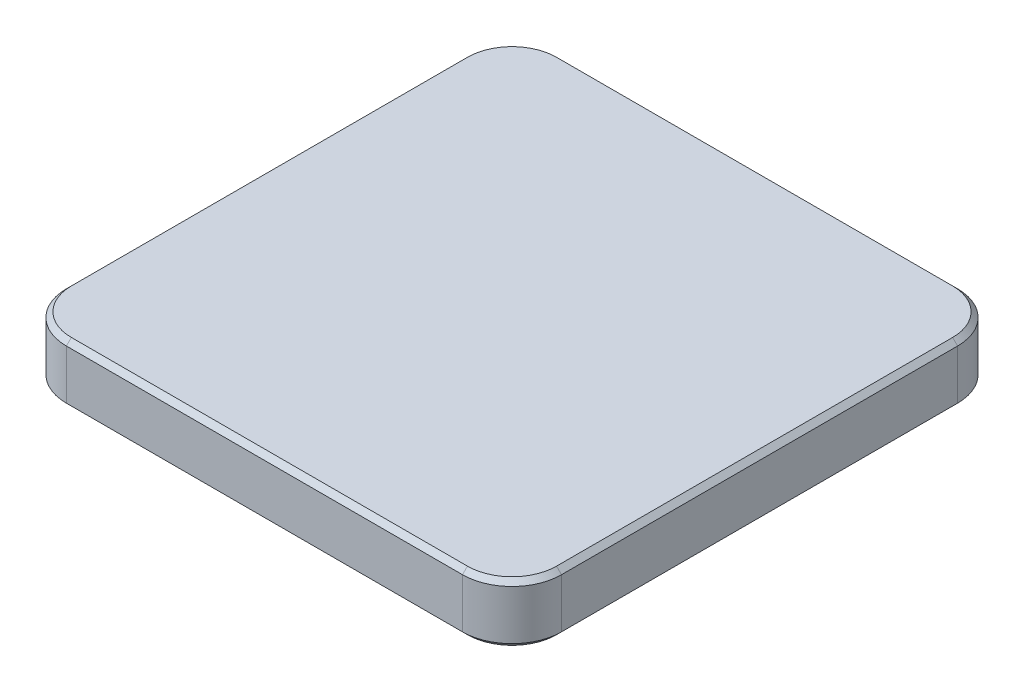
ISO-10303-21;
HEADER;
FILE_DESCRIPTION(('STEP AP214'),'2;1');
FILE_NAME('part.step','',(''),(''),'','','');
FILE_SCHEMA(('AUTOMOTIVE_DESIGN { 1 0 10303 214 1 1 1 1 }'));
ENDSEC;
DATA;
#1=APPLICATION_CONTEXT('core data for automotive mechanical design processes');
#2=APPLICATION_PROTOCOL_DEFINITION('international standard','automotive_design',2000,#1);
#3=PRODUCT_CONTEXT('',#1,'mechanical');
#4=PRODUCT('Part','Part','',(#3));
#5=PRODUCT_RELATED_PRODUCT_CATEGORY('part','',(#4));
#6=PRODUCT_DEFINITION_FORMATION('','',#4);
#7=PRODUCT_DEFINITION_CONTEXT('part definition',#1,'design');
#8=PRODUCT_DEFINITION('design','',#6,#7);
#9=PRODUCT_DEFINITION_SHAPE('','',#8);
#10=(LENGTH_UNIT() NAMED_UNIT(*) SI_UNIT(.MILLI.,.METRE.));
#11=(NAMED_UNIT(*) PLANE_ANGLE_UNIT() SI_UNIT($,.RADIAN.));
#12=(NAMED_UNIT(*) SI_UNIT($,.STERADIAN.) SOLID_ANGLE_UNIT());
#13=UNCERTAINTY_MEASURE_WITH_UNIT(LENGTH_MEASURE(1.E-05),#10,'distance_accuracy_value','');
#14=(GEOMETRIC_REPRESENTATION_CONTEXT(3) GLOBAL_UNCERTAINTY_ASSIGNED_CONTEXT((#13)) GLOBAL_UNIT_ASSIGNED_CONTEXT((#10,
#11,#12)) REPRESENTATION_CONTEXT('',''));
#15=CARTESIAN_POINT('',(0.,0.,0.));
#16=DIRECTION('',(0.,0.,1.));
#17=DIRECTION('',(1.,0.,0.));
#18=AXIS2_PLACEMENT_3D('',#15,#16,#17);
#19=CARTESIAN_POINT('',(-40.,12.,40.));
#20=DIRECTION('',(0.,-1.,0.));
#21=DIRECTION('',(0.,0.,-1.));
#22=AXIS2_PLACEMENT_3D('',#19,#20,#21);
#23=CYLINDRICAL_SURFACE('',#22,10.);
#24=DIRECTION('',(0.,-1.,0.));
#25=VECTOR('',#24,1.);
#26=CARTESIAN_POINT('',(-50.,12.,39.9999999999999));
#27=LINE('',#26,#25);
#28=CARTESIAN_POINT('',(-50.,11.,39.9999999999999));
#29=VERTEX_POINT('',#28);
#30=CARTESIAN_POINT('',(-50.,0.999999999999997,39.9999999999999));
#31=VERTEX_POINT('',#30);
#32=EDGE_CURVE('E268',#29,#31,#27,.T.);
#33=ORIENTED_EDGE('',*,*,#32,.T.);
#34=CARTESIAN_POINT('',(-40.,0.999999999999997,40.));
#35=DIRECTION('',(0.,-1.,0.));
#36=DIRECTION('',(0.,0.,-1.));
#37=AXIS2_PLACEMENT_3D('',#34,#35,#36);
#38=CIRCLE('',#37,10.);
#39=CARTESIAN_POINT('',(-39.9999999999999,0.999999999999997,50.));
#40=VERTEX_POINT('',#39);
#41=EDGE_CURVE('E233',#31,#40,#38,.F.);
#42=ORIENTED_EDGE('',*,*,#41,.T.);
#43=DIRECTION('',(0.,-1.,0.));
#44=VECTOR('',#43,1.);
#45=CARTESIAN_POINT('',(-39.9999999999999,12.,50.));
#46=LINE('',#45,#44);
#47=CARTESIAN_POINT('',(-39.9999999999999,11.,50.));
#48=VERTEX_POINT('',#47);
#49=EDGE_CURVE('E172',#48,#40,#46,.T.);
#50=ORIENTED_EDGE('',*,*,#49,.F.);
#51=CARTESIAN_POINT('',(-40.,11.,40.));
#52=DIRECTION('',(0.,-1.,0.));
#53=DIRECTION('',(0.,0.,-1.));
#54=AXIS2_PLACEMENT_3D('',#51,#52,#53);
#55=CIRCLE('',#54,10.);
#56=EDGE_CURVE('E231',#48,#29,#55,.T.);
#57=ORIENTED_EDGE('',*,*,#56,.T.);
#58=EDGE_LOOP('',(#33,#42,#50,#57));
#59=FACE_BOUND('',#58,.T.);
#60=ADVANCED_FACE('F35',(#59),#23,.T.);
#61=CARTESIAN_POINT('',(-39.9999999999999,12.,50.));
#62=DIRECTION('',(0.,0.,-1.));
#63=DIRECTION('',(-1.,0.,0.));
#64=AXIS2_PLACEMENT_3D('',#61,#62,#63);
#65=PLANE('',#64);
#66=ORIENTED_EDGE('',*,*,#49,.T.);
#67=DIRECTION('',(1.,0.,0.));
#68=VECTOR('',#67,1.);
#69=CARTESIAN_POINT('',(39.9999999999999,0.999999999999997,50.));
#70=LINE('',#69,#68);
#71=CARTESIAN_POINT('',(39.9999999999999,0.999999999999997,50.));
#72=VERTEX_POINT('',#71);
#73=EDGE_CURVE('E171',#40,#72,#70,.T.);
#74=ORIENTED_EDGE('',*,*,#73,.T.);
#75=DIRECTION('',(0.,-1.,0.));
#76=VECTOR('',#75,1.);
#77=CARTESIAN_POINT('',(39.9999999999999,12.,50.));
#78=LINE('',#77,#76);
#79=CARTESIAN_POINT('',(39.9999999999999,11.,50.));
#80=VERTEX_POINT('',#79);
#81=EDGE_CURVE('E153',#80,#72,#78,.T.);
#82=ORIENTED_EDGE('',*,*,#81,.F.);
#83=DIRECTION('',(-1.,0.,0.));
#84=VECTOR('',#83,1.);
#85=CARTESIAN_POINT('',(-39.9999999999999,11.,50.));
#86=LINE('',#85,#84);
#87=EDGE_CURVE('E168',#80,#48,#86,.T.);
#88=ORIENTED_EDGE('',*,*,#87,.T.);
#89=EDGE_LOOP('',(#66,#74,#82,#88));
#90=FACE_BOUND('',#89,.T.);
#91=ADVANCED_FACE('F166',(#90),#65,.F.);
#92=CARTESIAN_POINT('',(40.,12.,40.));
#93=DIRECTION('',(0.,-1.,0.));
#94=DIRECTION('',(0.,0.,-1.));
#95=AXIS2_PLACEMENT_3D('',#92,#93,#94);
#96=CYLINDRICAL_SURFACE('',#95,10.);
#97=ORIENTED_EDGE('',*,*,#81,.T.);
#98=CARTESIAN_POINT('',(40.,0.999999999999997,40.));
#99=DIRECTION('',(0.,-1.,0.));
#100=DIRECTION('',(0.,0.,-1.));
#101=AXIS2_PLACEMENT_3D('',#98,#99,#100);
#102=CIRCLE('',#101,10.);
#103=CARTESIAN_POINT('',(50.,0.999999999999997,39.9999999999999));
#104=VERTEX_POINT('',#103);
#105=EDGE_CURVE('E160',#72,#104,#102,.F.);
#106=ORIENTED_EDGE('',*,*,#105,.T.);
#107=DIRECTION('',(0.,-1.,0.));
#108=VECTOR('',#107,1.);
#109=CARTESIAN_POINT('',(50.,12.,39.9999999999999));
#110=LINE('',#109,#108);
#111=CARTESIAN_POINT('',(50.,11.,39.9999999999999));
#112=VERTEX_POINT('',#111);
#113=EDGE_CURVE('E155',#112,#104,#110,.T.);
#114=ORIENTED_EDGE('',*,*,#113,.F.);
#115=CARTESIAN_POINT('',(40.,11.,40.));
#116=DIRECTION('',(0.,-1.,0.));
#117=DIRECTION('',(0.,0.,-1.));
#118=AXIS2_PLACEMENT_3D('',#115,#116,#117);
#119=CIRCLE('',#118,10.);
#120=EDGE_CURVE('E150',#112,#80,#119,.T.);
#121=ORIENTED_EDGE('',*,*,#120,.T.);
#122=EDGE_LOOP('',(#97,#106,#114,#121));
#123=FACE_BOUND('',#122,.T.);
#124=ADVANCED_FACE('F152',(#123),#96,.T.);
#125=CARTESIAN_POINT('',(50.,12.,39.9999999999999));
#126=DIRECTION('',(-1.,0.,0.));
#127=DIRECTION('',(0.,0.,1.));
#128=AXIS2_PLACEMENT_3D('',#125,#126,#127);
#129=PLANE('',#128);
#130=ORIENTED_EDGE('',*,*,#113,.T.);
#131=DIRECTION('',(0.,0.,-1.));
#132=VECTOR('',#131,1.);
#133=CARTESIAN_POINT('',(50.,0.999999999999997,-39.9999999999999));
#134=LINE('',#133,#132);
#135=CARTESIAN_POINT('',(50.,0.999999999999997,-39.9999999999999));
#136=VERTEX_POINT('',#135);
#137=EDGE_CURVE('E212',#104,#136,#134,.T.);
#138=ORIENTED_EDGE('',*,*,#137,.T.);
#139=DIRECTION('',(0.,-1.,0.));
#140=VECTOR('',#139,1.);
#141=CARTESIAN_POINT('',(50.,12.,-39.9999999999999));
#142=LINE('',#141,#140);
#143=CARTESIAN_POINT('',(50.,11.,-39.9999999999999));
#144=VERTEX_POINT('',#143);
#145=EDGE_CURVE('E293',#144,#136,#142,.T.);
#146=ORIENTED_EDGE('',*,*,#145,.F.);
#147=DIRECTION('',(0.,0.,1.));
#148=VECTOR('',#147,1.);
#149=CARTESIAN_POINT('',(50.,11.,39.9999999999999));
#150=LINE('',#149,#148);
#151=EDGE_CURVE('E210',#144,#112,#150,.T.);
#152=ORIENTED_EDGE('',*,*,#151,.T.);
#153=EDGE_LOOP('',(#130,#138,#146,#152));
#154=FACE_BOUND('',#153,.T.);
#155=ADVANCED_FACE('F290',(#154),#129,.F.);
#156=CARTESIAN_POINT('',(40.,12.,-40.));
#157=DIRECTION('',(0.,-1.,0.));
#158=DIRECTION('',(0.,0.,-1.));
#159=AXIS2_PLACEMENT_3D('',#156,#157,#158);
#160=CYLINDRICAL_SURFACE('',#159,10.);
#161=ORIENTED_EDGE('',*,*,#145,.T.);
#162=CARTESIAN_POINT('',(40.,0.999999999999997,-40.));
#163=DIRECTION('',(0.,-1.,0.));
#164=DIRECTION('',(0.,0.,-1.));
#165=AXIS2_PLACEMENT_3D('',#162,#163,#164);
#166=CIRCLE('',#165,10.);
#167=CARTESIAN_POINT('',(39.9999999999999,0.999999999999997,-50.));
#168=VERTEX_POINT('',#167);
#169=EDGE_CURVE('E216',#136,#168,#166,.F.);
#170=ORIENTED_EDGE('',*,*,#169,.T.);
#171=DIRECTION('',(0.,-1.,0.));
#172=VECTOR('',#171,1.);
#173=CARTESIAN_POINT('',(39.9999999999999,12.,-50.));
#174=LINE('',#173,#172);
#175=CARTESIAN_POINT('',(39.9999999999999,11.,-50.));
#176=VERTEX_POINT('',#175);
#177=EDGE_CURVE('E296',#176,#168,#174,.T.);
#178=ORIENTED_EDGE('',*,*,#177,.F.);
#179=CARTESIAN_POINT('',(40.,11.,-40.));
#180=DIRECTION('',(0.,-1.,0.));
#181=DIRECTION('',(0.,0.,-1.));
#182=AXIS2_PLACEMENT_3D('',#179,#180,#181);
#183=CIRCLE('',#182,10.);
#184=EDGE_CURVE('E214',#176,#144,#183,.T.);
#185=ORIENTED_EDGE('',*,*,#184,.T.);
#186=EDGE_LOOP('',(#161,#170,#178,#185));
#187=FACE_BOUND('',#186,.T.);
#188=ADVANCED_FACE('F341',(#187),#160,.T.);
#189=CARTESIAN_POINT('',(-39.9999999999999,12.,-50.));
#190=DIRECTION('',(0.,0.,1.));
#191=DIRECTION('',(1.,0.,0.));
#192=AXIS2_PLACEMENT_3D('',#189,#190,#191);
#193=PLANE('',#192);
#194=ORIENTED_EDGE('',*,*,#177,.T.);
#195=DIRECTION('',(-1.,0.,0.));
#196=VECTOR('',#195,1.);
#197=CARTESIAN_POINT('',(-39.9999999999999,0.999999999999997,-50.));
#198=LINE('',#197,#196);
#199=CARTESIAN_POINT('',(-39.9999999999999,0.999999999999997,-50.));
#200=VERTEX_POINT('',#199);
#201=EDGE_CURVE('E220',#168,#200,#198,.T.);
#202=ORIENTED_EDGE('',*,*,#201,.T.);
#203=DIRECTION('',(0.,-1.,0.));
#204=VECTOR('',#203,1.);
#205=CARTESIAN_POINT('',(-39.9999999999999,12.,-50.));
#206=LINE('',#205,#204);
#207=CARTESIAN_POINT('',(-39.9999999999999,11.,-50.));
#208=VERTEX_POINT('',#207);
#209=EDGE_CURVE('E300',#208,#200,#206,.T.);
#210=ORIENTED_EDGE('',*,*,#209,.F.);
#211=DIRECTION('',(1.,0.,0.));
#212=VECTOR('',#211,1.);
#213=CARTESIAN_POINT('',(-39.9999999999999,11.,-50.));
#214=LINE('',#213,#212);
#215=EDGE_CURVE('E218',#208,#176,#214,.T.);
#216=ORIENTED_EDGE('',*,*,#215,.T.);
#217=EDGE_LOOP('',(#194,#202,#210,#216));
#218=FACE_BOUND('',#217,.T.);
#219=ADVANCED_FACE('F344',(#218),#193,.F.);
#220=CARTESIAN_POINT('',(-40.,12.,-40.));
#221=DIRECTION('',(0.,-1.,0.));
#222=DIRECTION('',(0.,0.,-1.));
#223=AXIS2_PLACEMENT_3D('',#220,#221,#222);
#224=CYLINDRICAL_SURFACE('',#223,10.);
#225=ORIENTED_EDGE('',*,*,#209,.T.);
#226=CARTESIAN_POINT('',(-40.,0.999999999999997,-40.));
#227=DIRECTION('',(0.,-1.,0.));
#228=DIRECTION('',(0.,0.,-1.));
#229=AXIS2_PLACEMENT_3D('',#226,#227,#228);
#230=CIRCLE('',#229,10.);
#231=CARTESIAN_POINT('',(-50.,0.999999999999997,-39.9999999999999));
#232=VERTEX_POINT('',#231);
#233=EDGE_CURVE('E224',#200,#232,#230,.F.);
#234=ORIENTED_EDGE('',*,*,#233,.T.);
#235=DIRECTION('',(0.,-1.,0.));
#236=VECTOR('',#235,1.);
#237=CARTESIAN_POINT('',(-50.,12.,-39.9999999999999));
#238=LINE('',#237,#236);
#239=CARTESIAN_POINT('',(-50.,11.,-39.9999999999999));
#240=VERTEX_POINT('',#239);
#241=EDGE_CURVE('E305',#240,#232,#238,.T.);
#242=ORIENTED_EDGE('',*,*,#241,.F.);
#243=CARTESIAN_POINT('',(-40.,11.,-40.));
#244=DIRECTION('',(0.,-1.,0.));
#245=DIRECTION('',(0.,0.,-1.));
#246=AXIS2_PLACEMENT_3D('',#243,#244,#245);
#247=CIRCLE('',#246,10.);
#248=EDGE_CURVE('E222',#240,#208,#247,.T.);
#249=ORIENTED_EDGE('',*,*,#248,.T.);
#250=EDGE_LOOP('',(#225,#234,#242,#249));
#251=FACE_BOUND('',#250,.T.);
#252=ADVANCED_FACE('F358',(#251),#224,.T.);
#253=CARTESIAN_POINT('',(-50.,12.,39.9999999999999));
#254=DIRECTION('',(1.,0.,0.));
#255=DIRECTION('',(0.,0.,-1.));
#256=AXIS2_PLACEMENT_3D('',#253,#254,#255);
#257=PLANE('',#256);
#258=ORIENTED_EDGE('',*,*,#241,.T.);
#259=DIRECTION('',(0.,0.,1.));
#260=VECTOR('',#259,1.);
#261=CARTESIAN_POINT('',(-50.,0.999999999999997,39.9999999999999));
#262=LINE('',#261,#260);
#263=EDGE_CURVE('E229',#232,#31,#262,.T.);
#264=ORIENTED_EDGE('',*,*,#263,.T.);
#265=ORIENTED_EDGE('',*,*,#32,.F.);
#266=DIRECTION('',(0.,0.,-1.));
#267=VECTOR('',#266,1.);
#268=CARTESIAN_POINT('',(-50.,11.,39.9999999999999));
#269=LINE('',#268,#267);
#270=EDGE_CURVE('E226',#29,#240,#269,.T.);
#271=ORIENTED_EDGE('',*,*,#270,.T.);
#272=EDGE_LOOP('',(#258,#264,#265,#271));
#273=FACE_BOUND('',#272,.T.);
#274=ADVANCED_FACE('F359',(#273),#257,.F.);
#275=CARTESIAN_POINT('',(-40.,12.,40.));
#276=DIRECTION('',(0.,-1.,0.));
#277=DIRECTION('',(0.,0.,-1.));
#278=AXIS2_PLACEMENT_3D('',#275,#276,#277);
#279=PLANE('',#278);
#280=CARTESIAN_POINT('',(-40.,12.,-40.));
#281=DIRECTION('',(0.,-1.,0.));
#282=DIRECTION('',(0.,0.,-1.));
#283=AXIS2_PLACEMENT_3D('',#280,#281,#282);
#284=CIRCLE('',#283,9.00000000000001);
#285=CARTESIAN_POINT('',(-39.9999999999999,12.,-49.));
#286=VERTEX_POINT('',#285);
#287=CARTESIAN_POINT('',(-49.,12.,-39.9999999999999));
#288=VERTEX_POINT('',#287);
#289=EDGE_CURVE('E45',#286,#288,#284,.F.);
#290=ORIENTED_EDGE('',*,*,#289,.T.);
#291=DIRECTION('',(0.,0.,1.));
#292=VECTOR('',#291,1.);
#293=CARTESIAN_POINT('',(-49.,12.,40.));
#294=LINE('',#293,#292);
#295=CARTESIAN_POINT('',(-49.,12.,39.9999999999999));
#296=VERTEX_POINT('',#295);
#297=EDGE_CURVE('E11',#288,#296,#294,.T.);
#298=ORIENTED_EDGE('',*,*,#297,.T.);
#299=CARTESIAN_POINT('',(-40.,12.,40.));
#300=DIRECTION('',(0.,-1.,0.));
#301=DIRECTION('',(0.,0.,-1.));
#302=AXIS2_PLACEMENT_3D('',#299,#300,#301);
#303=CIRCLE('',#302,9.00000000000001);
#304=CARTESIAN_POINT('',(-39.9999999999999,12.,49.));
#305=VERTEX_POINT('',#304);
#306=EDGE_CURVE('E235',#296,#305,#303,.F.);
#307=ORIENTED_EDGE('',*,*,#306,.T.);
#308=DIRECTION('',(1.,0.,0.));
#309=VECTOR('',#308,1.);
#310=CARTESIAN_POINT('',(-40.,12.,49.));
#311=LINE('',#310,#309);
#312=CARTESIAN_POINT('',(39.9999999999999,12.,49.));
#313=VERTEX_POINT('',#312);
#314=EDGE_CURVE('E237',#305,#313,#311,.T.);
#315=ORIENTED_EDGE('',*,*,#314,.T.);
#316=CARTESIAN_POINT('',(40.,12.,40.));
#317=DIRECTION('',(0.,-1.,0.));
#318=DIRECTION('',(0.,0.,-1.));
#319=AXIS2_PLACEMENT_3D('',#316,#317,#318);
#320=CIRCLE('',#319,9.00000000000001);
#321=CARTESIAN_POINT('',(49.,12.,39.9999999999999));
#322=VERTEX_POINT('',#321);
#323=EDGE_CURVE('E178',#313,#322,#320,.F.);
#324=ORIENTED_EDGE('',*,*,#323,.T.);
#325=DIRECTION('',(0.,0.,-1.));
#326=VECTOR('',#325,1.);
#327=CARTESIAN_POINT('',(49.,12.,40.));
#328=LINE('',#327,#326);
#329=CARTESIAN_POINT('',(49.,12.,-39.9999999999999));
#330=VERTEX_POINT('',#329);
#331=EDGE_CURVE('E240',#322,#330,#328,.T.);
#332=ORIENTED_EDGE('',*,*,#331,.T.);
#333=CARTESIAN_POINT('',(40.,12.,-40.));
#334=DIRECTION('',(0.,-1.,0.));
#335=DIRECTION('',(0.,0.,-1.));
#336=AXIS2_PLACEMENT_3D('',#333,#334,#335);
#337=CIRCLE('',#336,9.00000000000001);
#338=CARTESIAN_POINT('',(39.9999999999999,12.,-49.));
#339=VERTEX_POINT('',#338);
#340=EDGE_CURVE('E242',#330,#339,#337,.F.);
#341=ORIENTED_EDGE('',*,*,#340,.T.);
#342=DIRECTION('',(-1.,0.,0.));
#343=VECTOR('',#342,1.);
#344=CARTESIAN_POINT('',(-40.,12.,-49.));
#345=LINE('',#344,#343);
#346=EDGE_CURVE('E56',#339,#286,#345,.T.);
#347=ORIENTED_EDGE('',*,*,#346,.T.);
#348=EDGE_LOOP('',(#290,#298,#307,#315,#324,#332,#341,#347));
#349=FACE_BOUND('',#348,.T.);
#350=ADVANCED_FACE('F368',(#349),#279,.F.);
#351=CARTESIAN_POINT('',(-40.,0.,40.));
#352=DIRECTION('',(0.,-1.,0.));
#353=DIRECTION('',(0.,0.,-1.));
#354=AXIS2_PLACEMENT_3D('',#351,#352,#353);
#355=PLANE('',#354);
#356=CARTESIAN_POINT('',(40.,0.,40.));
#357=DIRECTION('',(0.,-1.,0.));
#358=DIRECTION('',(0.,0.,-1.));
#359=AXIS2_PLACEMENT_3D('',#356,#357,#358);
#360=CIRCLE('',#359,9.00000000000001);
#361=CARTESIAN_POINT('',(49.,0.,39.9999999999999));
#362=VERTEX_POINT('',#361);
#363=CARTESIAN_POINT('',(39.9999999999999,0.,49.));
#364=VERTEX_POINT('',#363);
#365=EDGE_CURVE('E205',#362,#364,#360,.T.);
#366=ORIENTED_EDGE('',*,*,#365,.T.);
#367=DIRECTION('',(-1.,0.,0.));
#368=VECTOR('',#367,1.);
#369=CARTESIAN_POINT('',(-39.9999999999999,0.,49.));
#370=LINE('',#369,#368);
#371=CARTESIAN_POINT('',(-39.9999999999999,0.,49.));
#372=VERTEX_POINT('',#371);
#373=EDGE_CURVE('E161',#364,#372,#370,.T.);
#374=ORIENTED_EDGE('',*,*,#373,.T.);
#375=CARTESIAN_POINT('',(-40.,0.,40.));
#376=DIRECTION('',(0.,-1.,0.));
#377=DIRECTION('',(0.,0.,-1.));
#378=AXIS2_PLACEMENT_3D('',#375,#376,#377);
#379=CIRCLE('',#378,9.00000000000001);
#380=CARTESIAN_POINT('',(-49.,0.,39.9999999999999));
#381=VERTEX_POINT('',#380);
#382=EDGE_CURVE('E190',#372,#381,#379,.T.);
#383=ORIENTED_EDGE('',*,*,#382,.T.);
#384=DIRECTION('',(0.,0.,-1.));
#385=VECTOR('',#384,1.);
#386=CARTESIAN_POINT('',(-49.,0.,-39.9999999999999));
#387=LINE('',#386,#385);
#388=CARTESIAN_POINT('',(-49.,0.,-39.9999999999999));
#389=VERTEX_POINT('',#388);
#390=EDGE_CURVE('E195',#381,#389,#387,.T.);
#391=ORIENTED_EDGE('',*,*,#390,.T.);
#392=CARTESIAN_POINT('',(-40.,0.,-40.));
#393=DIRECTION('',(0.,-1.,0.));
#394=DIRECTION('',(0.,0.,-1.));
#395=AXIS2_PLACEMENT_3D('',#392,#393,#394);
#396=CIRCLE('',#395,9.00000000000001);
#397=CARTESIAN_POINT('',(-39.9999999999999,0.,-49.));
#398=VERTEX_POINT('',#397);
#399=EDGE_CURVE('E197',#389,#398,#396,.T.);
#400=ORIENTED_EDGE('',*,*,#399,.T.);
#401=DIRECTION('',(1.,0.,0.));
#402=VECTOR('',#401,1.);
#403=CARTESIAN_POINT('',(39.9999999999999,0.,-49.));
#404=LINE('',#403,#402);
#405=CARTESIAN_POINT('',(39.9999999999999,0.,-49.));
#406=VERTEX_POINT('',#405);
#407=EDGE_CURVE('E199',#398,#406,#404,.T.);
#408=ORIENTED_EDGE('',*,*,#407,.T.);
#409=CARTESIAN_POINT('',(40.,0.,-40.));
#410=DIRECTION('',(0.,-1.,0.));
#411=DIRECTION('',(0.,0.,-1.));
#412=AXIS2_PLACEMENT_3D('',#409,#410,#411);
#413=CIRCLE('',#412,9.00000000000001);
#414=CARTESIAN_POINT('',(49.,0.,-39.9999999999999));
#415=VERTEX_POINT('',#414);
#416=EDGE_CURVE('E201',#406,#415,#413,.T.);
#417=ORIENTED_EDGE('',*,*,#416,.T.);
#418=DIRECTION('',(0.,0.,1.));
#419=VECTOR('',#418,1.);
#420=CARTESIAN_POINT('',(49.,0.,39.9999999999999));
#421=LINE('',#420,#419);
#422=EDGE_CURVE('E203',#415,#362,#421,.T.);
#423=ORIENTED_EDGE('',*,*,#422,.T.);
#424=EDGE_LOOP('',(#366,#374,#383,#391,#400,#408,#417,#423));
#425=FACE_BOUND('',#424,.T.);
#426=ADVANCED_FACE('F370',(#425),#355,.T.);
#427=CARTESIAN_POINT('',(-39.9999999999999,0.999999999999997,-50.));
#428=DIRECTION('',(0.,-0.707106781186544,-0.707106781186551));
#429=DIRECTION('',(1.,0.,0.));
#430=AXIS2_PLACEMENT_3D('',#427,#428,#429);
#431=PLANE('',#430);
#432=DIRECTION('',(0.,0.707106781186551,-0.707106781186544));
#433=VECTOR('',#432,1.);
#434=CARTESIAN_POINT('',(39.9999999999999,0.,-49.));
#435=LINE('',#434,#433);
#436=EDGE_CURVE('E262',#406,#168,#435,.T.);
#437=ORIENTED_EDGE('',*,*,#436,.F.);
#438=ORIENTED_EDGE('',*,*,#407,.F.);
#439=DIRECTION('',(0.,-0.707106781186551,0.707106781186544));
#440=VECTOR('',#439,1.);
#441=CARTESIAN_POINT('',(-39.9999999999999,0.999999999999997,-50.));
#442=LINE('',#441,#440);
#443=EDGE_CURVE('E265',#200,#398,#442,.T.);
#444=ORIENTED_EDGE('',*,*,#443,.F.);
#445=ORIENTED_EDGE('',*,*,#201,.F.);
#446=EDGE_LOOP('',(#437,#438,#444,#445));
#447=FACE_BOUND('',#446,.T.);
#448=ADVANCED_FACE('F349',(#447),#431,.T.);
#449=CARTESIAN_POINT('',(-40.,0.999999999999997,-40.));
#450=DIRECTION('',(0.,1.,0.));
#451=DIRECTION('',(0.,0.,1.));
#452=AXIS2_PLACEMENT_3D('',#449,#450,#451);
#453=CONICAL_SURFACE('',#452,10.,0.785398163397445);
#454=ORIENTED_EDGE('',*,*,#443,.T.);
#455=ORIENTED_EDGE('',*,*,#399,.F.);
#456=DIRECTION('',(0.707106781186544,-0.707106781186551,0.));
#457=VECTOR('',#456,1.);
#458=CARTESIAN_POINT('',(-50.,0.999999999999997,-39.9999999999999));
#459=LINE('',#458,#457);
#460=EDGE_CURVE('E259',#232,#389,#459,.T.);
#461=ORIENTED_EDGE('',*,*,#460,.F.);
#462=ORIENTED_EDGE('',*,*,#233,.F.);
#463=EDGE_LOOP('',(#454,#455,#461,#462));
#464=FACE_BOUND('',#463,.T.);
#465=ADVANCED_FACE('F355',(#464),#453,.T.);
#466=CARTESIAN_POINT('',(40.,0.999999999999997,-40.));
#467=DIRECTION('',(0.,1.,0.));
#468=DIRECTION('',(0.,0.,1.));
#469=AXIS2_PLACEMENT_3D('',#466,#467,#468);
#470=CONICAL_SURFACE('',#469,10.,0.785398163397445);
#471=ORIENTED_EDGE('',*,*,#436,.T.);
#472=ORIENTED_EDGE('',*,*,#169,.F.);
#473=DIRECTION('',(0.707106781186546,0.707106781186549,0.));
#474=VECTOR('',#473,1.);
#475=CARTESIAN_POINT('',(49.,0.,-39.9999999999999));
#476=LINE('',#475,#474);
#477=EDGE_CURVE('E256',#415,#136,#476,.T.);
#478=ORIENTED_EDGE('',*,*,#477,.F.);
#479=ORIENTED_EDGE('',*,*,#416,.F.);
#480=EDGE_LOOP('',(#471,#472,#478,#479));
#481=FACE_BOUND('',#480,.T.);
#482=ADVANCED_FACE('F338',(#481),#470,.T.);
#483=CARTESIAN_POINT('',(-50.,0.999999999999997,39.9999999999999));
#484=DIRECTION('',(-0.707106781186549,-0.707106781186546,0.));
#485=DIRECTION('',(0.,0.,-1.));
#486=AXIS2_PLACEMENT_3D('',#483,#484,#485);
#487=PLANE('',#486);
#488=ORIENTED_EDGE('',*,*,#460,.T.);
#489=ORIENTED_EDGE('',*,*,#390,.F.);
#490=DIRECTION('',(0.707106781186546,-0.707106781186549,0.));
#491=VECTOR('',#490,1.);
#492=CARTESIAN_POINT('',(-50.,0.999999999999997,39.9999999999999));
#493=LINE('',#492,#491);
#494=EDGE_CURVE('E253',#31,#381,#493,.T.);
#495=ORIENTED_EDGE('',*,*,#494,.F.);
#496=ORIENTED_EDGE('',*,*,#263,.F.);
#497=EDGE_LOOP('',(#488,#489,#495,#496));
#498=FACE_BOUND('',#497,.T.);
#499=ADVANCED_FACE('F318',(#498),#487,.T.);
#500=CARTESIAN_POINT('',(50.,0.999999999999997,39.9999999999999));
#501=DIRECTION('',(0.707106781186549,-0.707106781186546,0.));
#502=DIRECTION('',(0.,0.,1.));
#503=AXIS2_PLACEMENT_3D('',#500,#501,#502);
#504=PLANE('',#503);
#505=ORIENTED_EDGE('',*,*,#477,.T.);
#506=ORIENTED_EDGE('',*,*,#137,.F.);
#507=DIRECTION('',(0.707106781186546,0.707106781186549,0.));
#508=VECTOR('',#507,1.);
#509=CARTESIAN_POINT('',(49.,0.,39.9999999999999));
#510=LINE('',#509,#508);
#511=EDGE_CURVE('E250',#362,#104,#510,.T.);
#512=ORIENTED_EDGE('',*,*,#511,.F.);
#513=ORIENTED_EDGE('',*,*,#422,.F.);
#514=EDGE_LOOP('',(#505,#506,#512,#513));
#515=FACE_BOUND('',#514,.T.);
#516=ADVANCED_FACE('F334',(#515),#504,.T.);
#517=CARTESIAN_POINT('',(-40.,0.999999999999997,40.));
#518=DIRECTION('',(0.,1.,0.));
#519=DIRECTION('',(0.,0.,1.));
#520=AXIS2_PLACEMENT_3D('',#517,#518,#519);
#521=CONICAL_SURFACE('',#520,10.,0.785398163397445);
#522=ORIENTED_EDGE('',*,*,#494,.T.);
#523=ORIENTED_EDGE('',*,*,#382,.F.);
#524=DIRECTION('',(0.,-0.707106781186551,-0.707106781186544));
#525=VECTOR('',#524,1.);
#526=CARTESIAN_POINT('',(-39.9999999999999,0.999999999999997,50.));
#527=LINE('',#526,#525);
#528=EDGE_CURVE('E248',#40,#372,#527,.T.);
#529=ORIENTED_EDGE('',*,*,#528,.F.);
#530=ORIENTED_EDGE('',*,*,#41,.F.);
#531=EDGE_LOOP('',(#522,#523,#529,#530));
#532=FACE_BOUND('',#531,.T.);
#533=ADVANCED_FACE('F322',(#532),#521,.T.);
#534=CARTESIAN_POINT('',(40.,0.999999999999997,40.));
#535=DIRECTION('',(0.,1.,0.));
#536=DIRECTION('',(0.,0.,1.));
#537=AXIS2_PLACEMENT_3D('',#534,#535,#536);
#538=CONICAL_SURFACE('',#537,10.,0.785398163397445);
#539=ORIENTED_EDGE('',*,*,#511,.T.);
#540=ORIENTED_EDGE('',*,*,#105,.F.);
#541=DIRECTION('',(0.,0.707106781186551,0.707106781186544));
#542=VECTOR('',#541,1.);
#543=CARTESIAN_POINT('',(39.9999999999999,0.,49.));
#544=LINE('',#543,#542);
#545=EDGE_CURVE('E246',#364,#72,#544,.T.);
#546=ORIENTED_EDGE('',*,*,#545,.F.);
#547=ORIENTED_EDGE('',*,*,#365,.F.);
#548=EDGE_LOOP('',(#539,#540,#546,#547));
#549=FACE_BOUND('',#548,.T.);
#550=ADVANCED_FACE('F330',(#549),#538,.T.);
#551=CARTESIAN_POINT('',(-39.9999999999999,0.999999999999997,50.));
#552=DIRECTION('',(0.,-0.707106781186546,0.707106781186549));
#553=DIRECTION('',(-1.,0.,0.));
#554=AXIS2_PLACEMENT_3D('',#551,#552,#553);
#555=PLANE('',#554);
#556=ORIENTED_EDGE('',*,*,#528,.T.);
#557=ORIENTED_EDGE('',*,*,#373,.F.);
#558=ORIENTED_EDGE('',*,*,#545,.T.);
#559=ORIENTED_EDGE('',*,*,#73,.F.);
#560=EDGE_LOOP('',(#556,#557,#558,#559));
#561=FACE_BOUND('',#560,.T.);
#562=ADVANCED_FACE('F325',(#561),#555,.T.);
#563=CARTESIAN_POINT('',(49.,12.,40.));
#564=DIRECTION('',(-0.707106781186543,-0.707106781186552,0.));
#565=DIRECTION('',(0.,0.,-1.));
#566=AXIS2_PLACEMENT_3D('',#563,#564,#565);
#567=PLANE('',#566);
#568=DIRECTION('',(-0.707106781186552,0.707106781186543,0.));
#569=VECTOR('',#568,1.);
#570=CARTESIAN_POINT('',(50.,11.,39.9999999999999));
#571=LINE('',#570,#569);
#572=EDGE_CURVE('E277',#112,#322,#571,.T.);
#573=ORIENTED_EDGE('',*,*,#572,.F.);
#574=ORIENTED_EDGE('',*,*,#151,.F.);
#575=DIRECTION('',(0.707106781186552,-0.707106781186543,0.));
#576=VECTOR('',#575,1.);
#577=CARTESIAN_POINT('',(49.,12.,-39.9999999999999));
#578=LINE('',#577,#576);
#579=EDGE_CURVE('E40',#330,#144,#578,.T.);
#580=ORIENTED_EDGE('',*,*,#579,.F.);
#581=ORIENTED_EDGE('',*,*,#331,.F.);
#582=EDGE_LOOP('',(#573,#574,#580,#581));
#583=FACE_BOUND('',#582,.T.);
#584=ADVANCED_FACE('F38',(#583),#567,.F.);
#585=CARTESIAN_POINT('',(40.,12.,-40.));
#586=DIRECTION('',(0.,-1.,0.));
#587=DIRECTION('',(0.,0.,-1.));
#588=AXIS2_PLACEMENT_3D('',#585,#586,#587);
#589=CONICAL_SURFACE('',#588,9.00000000000001,0.785398163397456);
#590=ORIENTED_EDGE('',*,*,#579,.T.);
#591=ORIENTED_EDGE('',*,*,#184,.F.);
#592=DIRECTION('',(0.,-0.707106781186543,-0.707106781186552));
#593=VECTOR('',#592,1.);
#594=CARTESIAN_POINT('',(39.9999999999999,12.,-49.));
#595=LINE('',#594,#593);
#596=EDGE_CURVE('E181',#339,#176,#595,.T.);
#597=ORIENTED_EDGE('',*,*,#596,.F.);
#598=ORIENTED_EDGE('',*,*,#340,.F.);
#599=EDGE_LOOP('',(#590,#591,#597,#598));
#600=FACE_BOUND('',#599,.T.);
#601=ADVANCED_FACE('F283',(#600),#589,.T.);
#602=CARTESIAN_POINT('',(40.,12.,40.));
#603=DIRECTION('',(0.,-1.,0.));
#604=DIRECTION('',(0.,0.,-1.));
#605=AXIS2_PLACEMENT_3D('',#602,#603,#604);
#606=CONICAL_SURFACE('',#605,9.00000000000001,0.785398163397456);
#607=ORIENTED_EDGE('',*,*,#572,.T.);
#608=ORIENTED_EDGE('',*,*,#323,.F.);
#609=DIRECTION('',(0.,0.707106781186543,-0.707106781186552));
#610=VECTOR('',#609,1.);
#611=CARTESIAN_POINT('',(39.9999999999999,11.,50.));
#612=LINE('',#611,#610);
#613=EDGE_CURVE('E176',#80,#313,#612,.T.);
#614=ORIENTED_EDGE('',*,*,#613,.F.);
#615=ORIENTED_EDGE('',*,*,#120,.F.);
#616=EDGE_LOOP('',(#607,#608,#614,#615));
#617=FACE_BOUND('',#616,.T.);
#618=ADVANCED_FACE('F177',(#617),#606,.T.);
#619=CARTESIAN_POINT('',(-40.,12.,-49.));
#620=DIRECTION('',(0.,-0.707106781186554,0.707106781186541));
#621=DIRECTION('',(-1.,0.,0.));
#622=AXIS2_PLACEMENT_3D('',#619,#620,#621);
#623=PLANE('',#622);
#624=ORIENTED_EDGE('',*,*,#596,.T.);
#625=ORIENTED_EDGE('',*,*,#215,.F.);
#626=DIRECTION('',(0.,-0.707106781186541,-0.707106781186554));
#627=VECTOR('',#626,1.);
#628=CARTESIAN_POINT('',(-39.9999999999999,12.,-49.));
#629=LINE('',#628,#627);
#630=EDGE_CURVE('E182',#286,#208,#629,.T.);
#631=ORIENTED_EDGE('',*,*,#630,.F.);
#632=ORIENTED_EDGE('',*,*,#346,.F.);
#633=EDGE_LOOP('',(#624,#625,#631,#632));
#634=FACE_BOUND('',#633,.T.);
#635=ADVANCED_FACE('F450',(#634),#623,.F.);
#636=CARTESIAN_POINT('',(-40.,12.,49.));
#637=DIRECTION('',(0.,-0.707106781186552,-0.707106781186543));
#638=DIRECTION('',(1.,0.,0.));
#639=AXIS2_PLACEMENT_3D('',#636,#637,#638);
#640=PLANE('',#639);
#641=ORIENTED_EDGE('',*,*,#613,.T.);
#642=ORIENTED_EDGE('',*,*,#314,.F.);
#643=DIRECTION('',(0.,0.707106781186543,-0.707106781186552));
#644=VECTOR('',#643,1.);
#645=CARTESIAN_POINT('',(-39.9999999999999,11.,50.));
#646=LINE('',#645,#644);
#647=EDGE_CURVE('E187',#48,#305,#646,.T.);
#648=ORIENTED_EDGE('',*,*,#647,.F.);
#649=ORIENTED_EDGE('',*,*,#87,.F.);
#650=EDGE_LOOP('',(#641,#642,#648,#649));
#651=FACE_BOUND('',#650,.T.);
#652=ADVANCED_FACE('F185',(#651),#640,.F.);
#653=CARTESIAN_POINT('',(-40.,12.,-40.));
#654=DIRECTION('',(0.,-1.,0.));
#655=DIRECTION('',(0.,0.,-1.));
#656=AXIS2_PLACEMENT_3D('',#653,#654,#655);
#657=CONICAL_SURFACE('',#656,9.00000000000001,0.785398163397456);
#658=ORIENTED_EDGE('',*,*,#630,.T.);
#659=ORIENTED_EDGE('',*,*,#248,.F.);
#660=DIRECTION('',(-0.707106781186554,-0.707106781186541,0.));
#661=VECTOR('',#660,1.);
#662=CARTESIAN_POINT('',(-49.,12.,-39.9999999999999));
#663=LINE('',#662,#661);
#664=EDGE_CURVE('E271',#288,#240,#663,.T.);
#665=ORIENTED_EDGE('',*,*,#664,.F.);
#666=ORIENTED_EDGE('',*,*,#289,.F.);
#667=EDGE_LOOP('',(#658,#659,#665,#666));
#668=FACE_BOUND('',#667,.T.);
#669=ADVANCED_FACE('F438',(#668),#657,.T.);
#670=CARTESIAN_POINT('',(-40.,12.,40.));
#671=DIRECTION('',(0.,-1.,0.));
#672=DIRECTION('',(0.,0.,-1.));
#673=AXIS2_PLACEMENT_3D('',#670,#671,#672);
#674=CONICAL_SURFACE('',#673,9.00000000000001,0.785398163397456);
#675=ORIENTED_EDGE('',*,*,#647,.T.);
#676=ORIENTED_EDGE('',*,*,#306,.F.);
#677=DIRECTION('',(0.707106781186554,0.707106781186541,0.));
#678=VECTOR('',#677,1.);
#679=CARTESIAN_POINT('',(-50.,11.,39.9999999999999));
#680=LINE('',#679,#678);
#681=EDGE_CURVE('E269',#29,#296,#680,.T.);
#682=ORIENTED_EDGE('',*,*,#681,.F.);
#683=ORIENTED_EDGE('',*,*,#56,.F.);
#684=EDGE_LOOP('',(#675,#676,#682,#683));
#685=FACE_BOUND('',#684,.T.);
#686=ADVANCED_FACE('F367',(#685),#674,.T.);
#687=CARTESIAN_POINT('',(-49.,12.,40.));
#688=DIRECTION('',(0.707106781186543,-0.707106781186552,0.));
#689=DIRECTION('',(0.,0.,1.));
#690=AXIS2_PLACEMENT_3D('',#687,#688,#689);
#691=PLANE('',#690);
#692=ORIENTED_EDGE('',*,*,#664,.T.);
#693=ORIENTED_EDGE('',*,*,#270,.F.);
#694=ORIENTED_EDGE('',*,*,#681,.T.);
#695=ORIENTED_EDGE('',*,*,#297,.F.);
#696=EDGE_LOOP('',(#692,#693,#694,#695));
#697=FACE_BOUND('',#696,.T.);
#698=ADVANCED_FACE('F362',(#697),#691,.F.);
#699=CLOSED_SHELL('',(#60,#91,#124,#155,#188,#219,#252,#274,#350,#426,#448,#465,#482,#499,#516,
#533,#550,#562,#584,#601,#618,#635,#652,#669,#686,#698));
#700=MANIFOLD_SOLID_BREP('B2',#699);
#701=ADVANCED_BREP_SHAPE_REPRESENTATION('',(#18,#700),#14);
#702=SHAPE_DEFINITION_REPRESENTATION(#9,#701);
ENDSEC;
END-ISO-10303-21;
